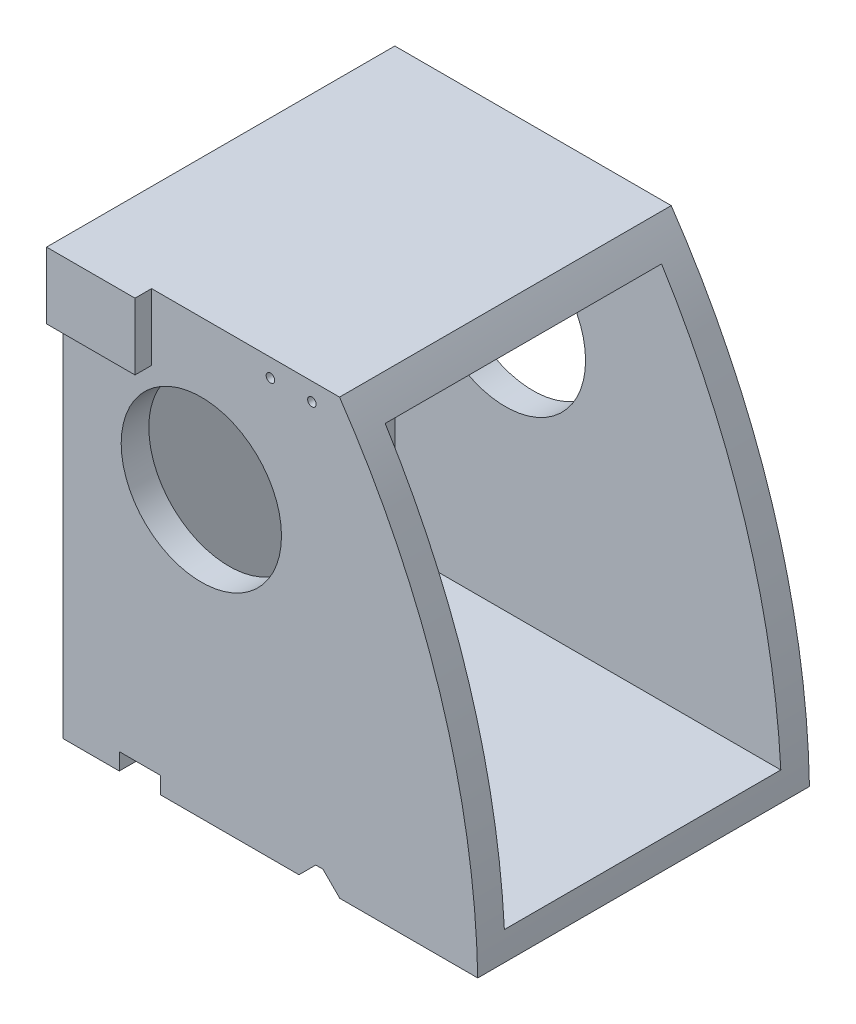
ISO-10303-21;
HEADER;
FILE_DESCRIPTION(('STEP AP214'),'2;1');
FILE_NAME('part.step','',(''),(''),'','','');
FILE_SCHEMA(('AUTOMOTIVE_DESIGN { 1 0 10303 214 1 1 1 1 }'));
ENDSEC;
DATA;
#1=APPLICATION_CONTEXT('core data for automotive mechanical design processes');
#2=APPLICATION_PROTOCOL_DEFINITION('international standard','automotive_design',2000,#1);
#3=PRODUCT_CONTEXT('',#1,'mechanical');
#4=PRODUCT('Part','Part','',(#3));
#5=PRODUCT_RELATED_PRODUCT_CATEGORY('part','',(#4));
#6=PRODUCT_DEFINITION_FORMATION('','',#4);
#7=PRODUCT_DEFINITION_CONTEXT('part definition',#1,'design');
#8=PRODUCT_DEFINITION('design','',#6,#7);
#9=PRODUCT_DEFINITION_SHAPE('','',#8);
#10=(LENGTH_UNIT() NAMED_UNIT(*) SI_UNIT(.MILLI.,.METRE.));
#11=(NAMED_UNIT(*) PLANE_ANGLE_UNIT() SI_UNIT($,.RADIAN.));
#12=(NAMED_UNIT(*) SI_UNIT($,.STERADIAN.) SOLID_ANGLE_UNIT());
#13=UNCERTAINTY_MEASURE_WITH_UNIT(LENGTH_MEASURE(1.E-05),#10,'distance_accuracy_value','');
#14=(GEOMETRIC_REPRESENTATION_CONTEXT(3) GLOBAL_UNCERTAINTY_ASSIGNED_CONTEXT((#13)) GLOBAL_UNIT_ASSIGNED_CONTEXT((#10,
#11,#12)) REPRESENTATION_CONTEXT('',''));
#15=CARTESIAN_POINT('',(0.,0.,0.));
#16=DIRECTION('',(0.,0.,1.));
#17=DIRECTION('',(1.,0.,0.));
#18=AXIS2_PLACEMENT_3D('',#15,#16,#17);
#19=CARTESIAN_POINT('',(-149.003633566678,-18.1360914015255,120.));
#20=DIRECTION('',(0.,0.,-1.));
#21=DIRECTION('',(-1.,0.,0.));
#22=AXIS2_PLACEMENT_3D('',#19,#20,#21);
#23=PLANE('',#22);
#24=CARTESIAN_POINT('',(64.9032258064516,137.910679099471,120.));
#25=DIRECTION('',(0.,0.,1.));
#26=DIRECTION('',(1.,0.,0.));
#27=AXIS2_PLACEMENT_3D('',#24,#25,#26);
#28=CIRCLE('',#27,1.5431870102377);
#29=CARTESIAN_POINT('',(66.4464128166893,137.910679099471,120.));
#30=VERTEX_POINT('',#29);
#31=EDGE_CURVE('E223',#30,#30,#28,.T.);
#32=ORIENTED_EDGE('',*,*,#31,.F.);
#33=EDGE_LOOP('',(#32));
#34=FACE_BOUND('',#33,.T.);
#35=CARTESIAN_POINT('',(79.9032258064516,137.910679099471,120.));
#36=DIRECTION('',(0.,0.,1.));
#37=DIRECTION('',(1.,0.,0.));
#38=AXIS2_PLACEMENT_3D('',#35,#36,#37);
#39=CIRCLE('',#38,1.5431870102377);
#40=CARTESIAN_POINT('',(81.4464128166893,137.910679099471,120.));
#41=VERTEX_POINT('',#40);
#42=EDGE_CURVE('E256',#41,#41,#39,.T.);
#43=ORIENTED_EDGE('',*,*,#42,.F.);
#44=EDGE_LOOP('',(#43));
#45=FACE_BOUND('',#44,.T.);
#46=CARTESIAN_POINT('',(39.9032258064516,90.4106790994713,120.));
#47=DIRECTION('',(0.,0.,1.));
#48=DIRECTION('',(1.,0.,0.));
#49=AXIS2_PLACEMENT_3D('',#46,#47,#48);
#50=CIRCLE('',#49,29.);
#51=CARTESIAN_POINT('',(68.9032258064516,90.4106790994713,120.));
#52=VERTEX_POINT('',#51);
#53=EDGE_CURVE('E251',#52,#52,#50,.T.);
#54=ORIENTED_EDGE('',*,*,#53,.F.);
#55=EDGE_LOOP('',(#54));
#56=FACE_BOUND('',#55,.T.);
#57=DIRECTION('',(0.,1.,0.));
#58=VECTOR('',#57,1.);
#59=CARTESIAN_POINT('',(21.9032258064516,144.410679099471,120.));
#60=LINE('',#59,#58);
#61=CARTESIAN_POINT('',(21.9032258064516,120.344673863571,120.));
#62=VERTEX_POINT('',#61);
#63=CARTESIAN_POINT('',(21.9032258064516,144.410679099471,120.));
#64=VERTEX_POINT('',#63);
#65=EDGE_CURVE('E190',#62,#64,#60,.T.);
#66=ORIENTED_EDGE('',*,*,#65,.F.);
#67=DIRECTION('',(1.,0.,0.));
#68=VECTOR('',#67,1.);
#69=CARTESIAN_POINT('',(-10.0967741935484,120.344673863571,120.));
#70=LINE('',#69,#68);
#71=CARTESIAN_POINT('',(-10.0967741935484,120.344673863571,120.));
#72=VERTEX_POINT('',#71);
#73=EDGE_CURVE('E55',#72,#62,#70,.T.);
#74=ORIENTED_EDGE('',*,*,#73,.F.);
#75=DIRECTION('',(0.,-1.,0.));
#76=VECTOR('',#75,1.);
#77=CARTESIAN_POINT('',(-10.0967741935484,144.410679099471,120.));
#78=LINE('',#77,#76);
#79=CARTESIAN_POINT('',(-10.0967741935484,-12.5893209005287,120.));
#80=VERTEX_POINT('',#79);
#81=EDGE_CURVE('E194',#72,#80,#78,.T.);
#82=ORIENTED_EDGE('',*,*,#81,.T.);
#83=DIRECTION('',(1.,0.,0.));
#84=VECTOR('',#83,1.);
#85=CARTESIAN_POINT('',(-10.0967741935484,-12.5893209005287,120.));
#86=LINE('',#85,#84);
#87=CARTESIAN_POINT('',(10.2155418262195,-12.5893209005287,120.));
#88=VERTEX_POINT('',#87);
#89=EDGE_CURVE('E322',#80,#88,#86,.T.);
#90=ORIENTED_EDGE('',*,*,#89,.T.);
#91=DIRECTION('',(0.,-1.,0.));
#92=VECTOR('',#91,1.);
#93=CARTESIAN_POINT('',(10.2155418262195,-12.5893209005287,120.));
#94=LINE('',#93,#92);
#95=CARTESIAN_POINT('',(10.2155418262195,-6.50411938261187,120.));
#96=VERTEX_POINT('',#95);
#97=EDGE_CURVE('E216',#96,#88,#94,.T.);
#98=ORIENTED_EDGE('',*,*,#97,.F.);
#99=DIRECTION('',(-1.,0.,0.));
#100=VECTOR('',#99,1.);
#101=CARTESIAN_POINT('',(25.2155418262195,-6.50411938261187,120.));
#102=LINE('',#101,#100);
#103=CARTESIAN_POINT('',(25.2155418262195,-6.50411938261187,120.));
#104=VERTEX_POINT('',#103);
#105=EDGE_CURVE('E211',#104,#96,#102,.T.);
#106=ORIENTED_EDGE('',*,*,#105,.F.);
#107=DIRECTION('',(0.,1.,0.));
#108=VECTOR('',#107,1.);
#109=CARTESIAN_POINT('',(25.2155418262195,-12.5893209005287,120.));
#110=LINE('',#109,#108);
#111=CARTESIAN_POINT('',(25.2155418262195,-12.5893209005287,120.));
#112=VERTEX_POINT('',#111);
#113=EDGE_CURVE('E207',#112,#104,#110,.T.);
#114=ORIENTED_EDGE('',*,*,#113,.F.);
#115=CARTESIAN_POINT('',(75.2155418262195,-12.5893209005287,120.));
#116=VERTEX_POINT('',#115);
#117=EDGE_CURVE('E327',#112,#116,#86,.T.);
#118=ORIENTED_EDGE('',*,*,#117,.T.);
#119=DIRECTION('',(-0.707106781186547,-0.707106781186548,0.));
#120=VECTOR('',#119,1.);
#121=CARTESIAN_POINT('',(75.2155418262195,-12.5893209005287,120.));
#122=LINE('',#121,#120);
#123=CARTESIAN_POINT('',(81.3007433441363,-6.50411938261186,120.));
#124=VERTEX_POINT('',#123);
#125=EDGE_CURVE('E236',#124,#116,#122,.T.);
#126=ORIENTED_EDGE('',*,*,#125,.F.);
#127=DIRECTION('',(-1.,0.,0.));
#128=VECTOR('',#127,1.);
#129=CARTESIAN_POINT('',(81.3007433441363,-6.50411938261186,120.));
#130=LINE('',#129,#128);
#131=CARTESIAN_POINT('',(83.9032258064516,-6.50411938261186,120.));
#132=VERTEX_POINT('',#131);
#133=EDGE_CURVE('E201',#132,#124,#130,.T.);
#134=ORIENTED_EDGE('',*,*,#133,.F.);
#135=DIRECTION('',(-0.707106781186546,0.707106781186549,0.));
#136=VECTOR('',#135,1.);
#137=CARTESIAN_POINT('',(83.9032258064516,-6.50411938261186,120.));
#138=LINE('',#137,#136);
#139=CARTESIAN_POINT('',(89.9884273243684,-12.5893209005287,120.));
#140=VERTEX_POINT('',#139);
#141=EDGE_CURVE('E196',#140,#132,#138,.T.);
#142=ORIENTED_EDGE('',*,*,#141,.F.);
#143=CARTESIAN_POINT('',(139.903225806452,-12.5893209005287,120.));
#144=VERTEX_POINT('',#143);
#145=EDGE_CURVE('E320',#140,#144,#86,.T.);
#146=ORIENTED_EDGE('',*,*,#145,.T.);
#147=CARTESIAN_POINT('',(-149.003633566678,-18.1360914015255,120.));
#148=DIRECTION('',(0.,0.,1.));
#149=DIRECTION('',(-1.,0.,0.));
#150=AXIS2_PLACEMENT_3D('',#147,#148,#149);
#151=CIRCLE('',#150,288.960101148647);
#152=CARTESIAN_POINT('',(89.9032258064516,144.410679099471,120.));
#153=VERTEX_POINT('',#152);
#154=EDGE_CURVE('E326',#144,#153,#151,.T.);
#155=ORIENTED_EDGE('',*,*,#154,.T.);
#156=DIRECTION('',(-1.,0.,0.));
#157=VECTOR('',#156,1.);
#158=CARTESIAN_POINT('',(-10.0967741935484,144.410679099471,120.));
#159=LINE('',#158,#157);
#160=EDGE_CURVE('E61',#153,#64,#159,.T.);
#161=ORIENTED_EDGE('',*,*,#160,.T.);
#162=EDGE_LOOP('',(#66,#74,#82,#90,#98,#106,#114,#118,#126,#134,#142,#146,#155,#161));
#163=FACE_BOUND('',#162,.T.);
#164=ADVANCED_FACE('F39',(#34,#45,#56,#163),#23,.F.);
#165=CARTESIAN_POINT('',(-10.0967741935484,-12.5893209005287,120.));
#166=DIRECTION('',(0.,1.,0.));
#167=DIRECTION('',(0.,0.,1.));
#168=AXIS2_PLACEMENT_3D('',#165,#166,#167);
#169=PLANE('',#168);
#170=ORIENTED_EDGE('',*,*,#117,.F.);
#171=DIRECTION('',(0.,0.,1.));
#172=VECTOR('',#171,1.);
#173=CARTESIAN_POINT('',(25.2155418262195,-12.5893209005287,-80.));
#174=LINE('',#173,#172);
#175=CARTESIAN_POINT('',(25.2155418262195,-12.5893209005287,0.));
#176=VERTEX_POINT('',#175);
#177=EDGE_CURVE('E220',#176,#112,#174,.T.);
#178=ORIENTED_EDGE('',*,*,#177,.F.);
#179=DIRECTION('',(1.,0.,0.));
#180=VECTOR('',#179,1.);
#181=CARTESIAN_POINT('',(-10.0967741935484,-12.5893209005287,0.));
#182=LINE('',#181,#180);
#183=CARTESIAN_POINT('',(75.2155418262195,-12.5893209005287,0.));
#184=VERTEX_POINT('',#183);
#185=EDGE_CURVE('E341',#176,#184,#182,.T.);
#186=ORIENTED_EDGE('',*,*,#185,.T.);
#187=DIRECTION('',(0.,0.,1.));
#188=VECTOR('',#187,1.);
#189=CARTESIAN_POINT('',(75.2155418262195,-12.5893209005287,-80.));
#190=LINE('',#189,#188);
#191=EDGE_CURVE('E212',#184,#116,#190,.T.);
#192=ORIENTED_EDGE('',*,*,#191,.T.);
#193=EDGE_LOOP('',(#170,#178,#186,#192));
#194=FACE_BOUND('',#193,.T.);
#195=ADVANCED_FACE('F427',(#194),#169,.F.);
#196=CARTESIAN_POINT('',(-10.0967741935484,-12.5893209005287,0.));
#197=VERTEX_POINT('',#196);
#198=CARTESIAN_POINT('',(10.2155418262195,-12.5893209005287,0.));
#199=VERTEX_POINT('',#198);
#200=EDGE_CURVE('E336',#197,#199,#182,.T.);
#201=ORIENTED_EDGE('',*,*,#200,.T.);
#202=DIRECTION('',(0.,0.,1.));
#203=VECTOR('',#202,1.);
#204=CARTESIAN_POINT('',(10.2155418262195,-12.5893209005287,-80.));
#205=LINE('',#204,#203);
#206=EDGE_CURVE('E224',#199,#88,#205,.T.);
#207=ORIENTED_EDGE('',*,*,#206,.T.);
#208=ORIENTED_EDGE('',*,*,#89,.F.);
#209=DIRECTION('',(0.,0.,-1.));
#210=VECTOR('',#209,1.);
#211=CARTESIAN_POINT('',(-10.0967741935484,-12.5893209005287,120.));
#212=LINE('',#211,#210);
#213=EDGE_CURVE('E356',#80,#197,#212,.T.);
#214=ORIENTED_EDGE('',*,*,#213,.T.);
#215=EDGE_LOOP('',(#201,#207,#208,#214));
#216=FACE_BOUND('',#215,.T.);
#217=ADVANCED_FACE('F405',(#216),#169,.F.);
#218=CARTESIAN_POINT('',(-149.003633566678,-18.1360914015255,120.));
#219=DIRECTION('',(0.,0.,-1.));
#220=DIRECTION('',(-1.,0.,0.));
#221=AXIS2_PLACEMENT_3D('',#218,#219,#220);
#222=CYLINDRICAL_SURFACE('',#221,288.960101148647);
#223=CARTESIAN_POINT('',(-149.003633566678,-18.1360914015255,0.));
#224=DIRECTION('',(0.,0.,1.));
#225=DIRECTION('',(-1.,0.,0.));
#226=AXIS2_PLACEMENT_3D('',#223,#224,#225);
#227=CIRCLE('',#226,288.960101148647);
#228=CARTESIAN_POINT('',(139.903225806452,-12.5893209005287,0.));
#229=VERTEX_POINT('',#228);
#230=CARTESIAN_POINT('',(89.9032258064516,144.410679099471,0.));
#231=VERTEX_POINT('',#230);
#232=EDGE_CURVE('E340',#229,#231,#227,.T.);
#233=ORIENTED_EDGE('',*,*,#232,.T.);
#234=DIRECTION('',(0.,0.,-1.));
#235=VECTOR('',#234,1.);
#236=CARTESIAN_POINT('',(89.9032258064516,144.410679099471,120.));
#237=LINE('',#236,#235);
#238=EDGE_CURVE('E348',#153,#231,#237,.T.);
#239=ORIENTED_EDGE('',*,*,#238,.F.);
#240=ORIENTED_EDGE('',*,*,#154,.F.);
#241=DIRECTION('',(0.,0.,-1.));
#242=VECTOR('',#241,1.);
#243=CARTESIAN_POINT('',(139.903225806452,-12.5893209005287,120.));
#244=LINE('',#243,#242);
#245=EDGE_CURVE('E352',#144,#229,#244,.T.);
#246=ORIENTED_EDGE('',*,*,#245,.T.);
#247=EDGE_LOOP('',(#233,#239,#240,#246));
#248=FACE_BOUND('',#247,.T.);
#249=CARTESIAN_POINT('',(-149.003633566678,-18.1360914015255,9.99999999999999));
#250=DIRECTION('',(0.,0.,-1.));
#251=DIRECTION('',(-1.,0.,0.));
#252=AXIS2_PLACEMENT_3D('',#249,#250,#251);
#253=CIRCLE('',#252,288.960101148647);
#254=CARTESIAN_POINT('',(139.537937065398,-2.58932090052872,10.));
#255=VERTEX_POINT('',#254);
#256=CARTESIAN_POINT('',(96.4091266263328,134.410679099471,10.));
#257=VERTEX_POINT('',#256);
#258=EDGE_CURVE('E298',#255,#257,#253,.F.);
#259=ORIENTED_EDGE('',*,*,#258,.F.);
#260=DIRECTION('',(0.,0.,-1.));
#261=VECTOR('',#260,1.);
#262=CARTESIAN_POINT('',(139.537937065398,-2.58932090052872,110.));
#263=LINE('',#262,#261);
#264=CARTESIAN_POINT('',(139.537937065398,-2.58932090052872,110.));
#265=VERTEX_POINT('',#264);
#266=EDGE_CURVE('E283',#265,#255,#263,.T.);
#267=ORIENTED_EDGE('',*,*,#266,.F.);
#268=CARTESIAN_POINT('',(-149.003633566678,-18.1360914015255,110.));
#269=DIRECTION('',(0.,0.,-1.));
#270=DIRECTION('',(-1.,0.,0.));
#271=AXIS2_PLACEMENT_3D('',#268,#269,#270);
#272=CIRCLE('',#271,288.960101148647);
#273=CARTESIAN_POINT('',(96.4091266263328,134.410679099471,110.));
#274=VERTEX_POINT('',#273);
#275=EDGE_CURVE('E302',#265,#274,#272,.F.);
#276=ORIENTED_EDGE('',*,*,#275,.T.);
#277=DIRECTION('',(0.,0.,-1.));
#278=VECTOR('',#277,1.);
#279=CARTESIAN_POINT('',(96.4091266263328,134.410679099471,110.));
#280=LINE('',#279,#278);
#281=EDGE_CURVE('E294',#274,#257,#280,.T.);
#282=ORIENTED_EDGE('',*,*,#281,.T.);
#283=EDGE_LOOP('',(#259,#267,#276,#282));
#284=FACE_BOUND('',#283,.T.);
#285=ADVANCED_FACE('F415',(#248,#284),#222,.T.);
#286=CARTESIAN_POINT('',(-10.0967741935484,144.410679099471,120.));
#287=DIRECTION('',(1.,0.,0.));
#288=DIRECTION('',(0.,1.,0.));
#289=AXIS2_PLACEMENT_3D('',#286,#287,#288);
#290=PLANE('',#289);
#291=DIRECTION('',(0.,-1.,0.));
#292=VECTOR('',#291,1.);
#293=CARTESIAN_POINT('',(-10.0967741935484,144.410679099471,0.));
#294=LINE('',#293,#292);
#295=CARTESIAN_POINT('',(-10.0967741935484,144.410679099471,0.));
#296=VERTEX_POINT('',#295);
#297=EDGE_CURVE('E282',#296,#197,#294,.T.);
#298=ORIENTED_EDGE('',*,*,#297,.T.);
#299=ORIENTED_EDGE('',*,*,#213,.F.);
#300=ORIENTED_EDGE('',*,*,#81,.F.);
#301=DIRECTION('',(0.,0.,-1.));
#302=VECTOR('',#301,1.);
#303=CARTESIAN_POINT('',(-10.0967741935484,120.344673863571,126.));
#304=LINE('',#303,#302);
#305=CARTESIAN_POINT('',(-10.0967741935484,120.344673863571,126.));
#306=VERTEX_POINT('',#305);
#307=EDGE_CURVE('E173',#306,#72,#304,.T.);
#308=ORIENTED_EDGE('',*,*,#307,.F.);
#309=DIRECTION('',(0.,-1.,0.));
#310=VECTOR('',#309,1.);
#311=CARTESIAN_POINT('',(-10.0967741935484,144.410679099471,126.));
#312=LINE('',#311,#310);
#313=CARTESIAN_POINT('',(-10.0967741935484,144.410679099471,126.));
#314=VERTEX_POINT('',#313);
#315=EDGE_CURVE('E180',#314,#306,#312,.T.);
#316=ORIENTED_EDGE('',*,*,#315,.F.);
#317=DIRECTION('',(0.,0.,-1.));
#318=VECTOR('',#317,1.);
#319=CARTESIAN_POINT('',(-10.0967741935484,144.410679099471,120.));
#320=LINE('',#319,#318);
#321=EDGE_CURVE('E332',#314,#296,#320,.T.);
#322=ORIENTED_EDGE('',*,*,#321,.T.);
#323=EDGE_LOOP('',(#298,#299,#300,#308,#316,#322));
#324=FACE_BOUND('',#323,.T.);
#325=ADVANCED_FACE('F41',(#324),#290,.F.);
#326=ORIENTED_EDGE('',*,*,#145,.F.);
#327=DIRECTION('',(0.,0.,1.));
#328=VECTOR('',#327,1.);
#329=CARTESIAN_POINT('',(89.9884273243684,-12.5893209005287,-80.));
#330=LINE('',#329,#328);
#331=CARTESIAN_POINT('',(89.9884273243684,-12.5893209005287,0.));
#332=VERTEX_POINT('',#331);
#333=EDGE_CURVE('E239',#332,#140,#330,.T.);
#334=ORIENTED_EDGE('',*,*,#333,.F.);
#335=EDGE_CURVE('E335',#332,#229,#182,.T.);
#336=ORIENTED_EDGE('',*,*,#335,.T.);
#337=ORIENTED_EDGE('',*,*,#245,.F.);
#338=EDGE_LOOP('',(#326,#334,#336,#337));
#339=FACE_BOUND('',#338,.T.);
#340=ADVANCED_FACE('F440',(#339),#169,.F.);
#341=CARTESIAN_POINT('',(-10.0967741935484,144.410679099471,120.));
#342=DIRECTION('',(0.,-1.,0.));
#343=DIRECTION('',(0.,0.,-1.));
#344=AXIS2_PLACEMENT_3D('',#341,#342,#343);
#345=PLANE('',#344);
#346=DIRECTION('',(-1.,0.,0.));
#347=VECTOR('',#346,1.);
#348=CARTESIAN_POINT('',(-10.0967741935484,144.410679099471,0.));
#349=LINE('',#348,#347);
#350=EDGE_CURVE('E321',#231,#296,#349,.T.);
#351=ORIENTED_EDGE('',*,*,#350,.T.);
#352=ORIENTED_EDGE('',*,*,#321,.F.);
#353=DIRECTION('',(-1.,0.,0.));
#354=VECTOR('',#353,1.);
#355=CARTESIAN_POINT('',(-10.0967741935484,144.410679099471,126.));
#356=LINE('',#355,#354);
#357=CARTESIAN_POINT('',(21.9032258064516,144.410679099471,126.));
#358=VERTEX_POINT('',#357);
#359=EDGE_CURVE('E186',#358,#314,#356,.T.);
#360=ORIENTED_EDGE('',*,*,#359,.F.);
#361=DIRECTION('',(0.,0.,-1.));
#362=VECTOR('',#361,1.);
#363=CARTESIAN_POINT('',(21.9032258064516,144.410679099471,126.));
#364=LINE('',#363,#362);
#365=EDGE_CURVE('E203',#358,#64,#364,.T.);
#366=ORIENTED_EDGE('',*,*,#365,.T.);
#367=ORIENTED_EDGE('',*,*,#160,.F.);
#368=ORIENTED_EDGE('',*,*,#238,.T.);
#369=EDGE_LOOP('',(#351,#352,#360,#366,#367,#368));
#370=FACE_BOUND('',#369,.T.);
#371=ADVANCED_FACE('F410',(#370),#345,.F.);
#372=CARTESIAN_POINT('',(-149.003633566678,-18.1360914015255,0.));
#373=DIRECTION('',(0.,0.,-1.));
#374=DIRECTION('',(-1.,0.,0.));
#375=AXIS2_PLACEMENT_3D('',#372,#373,#374);
#376=PLANE('',#375);
#377=DIRECTION('',(0.,-1.,0.));
#378=VECTOR('',#377,1.);
#379=CARTESIAN_POINT('',(25.2155418262195,-18.1360914015255,0.));
#380=LINE('',#379,#378);
#381=CARTESIAN_POINT('',(25.2155418262195,-6.50411938261187,0.));
#382=VERTEX_POINT('',#381);
#383=EDGE_CURVE('E11',#382,#176,#380,.T.);
#384=ORIENTED_EDGE('',*,*,#383,.F.);
#385=DIRECTION('',(1.,0.,0.));
#386=VECTOR('',#385,1.);
#387=CARTESIAN_POINT('',(-149.003633566678,-6.50411938261189,0.));
#388=LINE('',#387,#386);
#389=CARTESIAN_POINT('',(10.2155418262195,-6.50411938261187,0.));
#390=VERTEX_POINT('',#389);
#391=EDGE_CURVE('E379',#390,#382,#388,.T.);
#392=ORIENTED_EDGE('',*,*,#391,.F.);
#393=DIRECTION('',(0.,1.,0.));
#394=VECTOR('',#393,1.);
#395=CARTESIAN_POINT('',(10.2155418262195,-18.1360914015255,0.));
#396=LINE('',#395,#394);
#397=EDGE_CURVE('E48',#199,#390,#396,.T.);
#398=ORIENTED_EDGE('',*,*,#397,.F.);
#399=ORIENTED_EDGE('',*,*,#200,.F.);
#400=ORIENTED_EDGE('',*,*,#297,.F.);
#401=ORIENTED_EDGE('',*,*,#350,.F.);
#402=ORIENTED_EDGE('',*,*,#232,.F.);
#403=ORIENTED_EDGE('',*,*,#335,.F.);
#404=DIRECTION('',(0.707106781186546,-0.707106781186549,0.));
#405=VECTOR('',#404,1.);
#406=CARTESIAN_POINT('',(-26.7342178706559,104.133324294496,0.));
#407=LINE('',#406,#405);
#408=CARTESIAN_POINT('',(83.9032258064516,-6.50411938261186,0.));
#409=VERTEX_POINT('',#408);
#410=EDGE_CURVE('E360',#409,#332,#407,.T.);
#411=ORIENTED_EDGE('',*,*,#410,.F.);
#412=DIRECTION('',(1.,0.,0.));
#413=VECTOR('',#412,1.);
#414=CARTESIAN_POINT('',(-149.003633566678,-6.50411938261186,0.));
#415=LINE('',#414,#413);
#416=CARTESIAN_POINT('',(81.3007433441363,-6.50411938261186,0.));
#417=VERTEX_POINT('',#416);
#418=EDGE_CURVE('E372',#417,#409,#415,.T.);
#419=ORIENTED_EDGE('',*,*,#418,.F.);
#420=DIRECTION('',(0.707106781186547,0.707106781186548,0.));
#421=VECTOR('',#420,1.);
#422=CARTESIAN_POINT('',(-39.6674311207275,-127.472293847476,0.));
#423=LINE('',#422,#421);
#424=EDGE_CURVE('E376',#184,#417,#423,.T.);
#425=ORIENTED_EDGE('',*,*,#424,.F.);
#426=ORIENTED_EDGE('',*,*,#185,.F.);
#427=EDGE_LOOP('',(#384,#392,#398,#399,#400,#401,#402,#403,#411,#419,#425,#426));
#428=FACE_BOUND('',#427,.T.);
#429=CARTESIAN_POINT('',(39.9032258064516,90.4106790994713,0.));
#430=DIRECTION('',(0.,0.,-1.));
#431=DIRECTION('',(-1.,0.,0.));
#432=AXIS2_PLACEMENT_3D('',#429,#430,#431);
#433=CIRCLE('',#432,29.);
#434=CARTESIAN_POINT('',(10.9032258064516,90.4106790994713,0.));
#435=VERTEX_POINT('',#434);
#436=EDGE_CURVE('E267',#435,#435,#433,.T.);
#437=ORIENTED_EDGE('',*,*,#436,.F.);
#438=EDGE_LOOP('',(#437));
#439=FACE_BOUND('',#438,.T.);
#440=CARTESIAN_POINT('',(79.9032258064516,137.910679099471,0.));
#441=DIRECTION('',(0.,0.,-1.));
#442=DIRECTION('',(-1.,0.,0.));
#443=AXIS2_PLACEMENT_3D('',#440,#441,#442);
#444=CIRCLE('',#443,1.5431870102377);
#445=CARTESIAN_POINT('',(78.3600387962139,137.910679099471,0.));
#446=VERTEX_POINT('',#445);
#447=EDGE_CURVE('E277',#446,#446,#444,.T.);
#448=ORIENTED_EDGE('',*,*,#447,.F.);
#449=EDGE_LOOP('',(#448));
#450=FACE_BOUND('',#449,.T.);
#451=CARTESIAN_POINT('',(64.9032258064516,137.910679099471,0.));
#452=DIRECTION('',(0.,0.,-1.));
#453=DIRECTION('',(-1.,0.,0.));
#454=AXIS2_PLACEMENT_3D('',#451,#452,#453);
#455=CIRCLE('',#454,1.5431870102377);
#456=CARTESIAN_POINT('',(63.3600387962139,137.910679099471,0.));
#457=VERTEX_POINT('',#456);
#458=EDGE_CURVE('E271',#457,#457,#455,.T.);
#459=ORIENTED_EDGE('',*,*,#458,.F.);
#460=EDGE_LOOP('',(#459));
#461=FACE_BOUND('',#460,.T.);
#462=ADVANCED_FACE('F389',(#428,#439,#450,#461),#376,.T.);
#463=CARTESIAN_POINT('',(-0.0967741935484056,144.410679099471,120.));
#464=DIRECTION('',(1.,0.,0.));
#465=DIRECTION('',(0.,1.,0.));
#466=AXIS2_PLACEMENT_3D('',#463,#464,#465);
#467=PLANE('',#466);
#468=DIRECTION('',(0.,-1.,0.));
#469=VECTOR('',#468,1.);
#470=CARTESIAN_POINT('',(-0.0967741935483935,-18.1360914015255,10.));
#471=LINE('',#470,#469);
#472=CARTESIAN_POINT('',(-0.0967741935484058,134.410679099471,10.));
#473=VERTEX_POINT('',#472);
#474=CARTESIAN_POINT('',(-0.0967741935484088,-2.58932090052872,10.));
#475=VERTEX_POINT('',#474);
#476=EDGE_CURVE('E272',#473,#475,#471,.T.);
#477=ORIENTED_EDGE('',*,*,#476,.F.);
#478=DIRECTION('',(0.,0.,-1.));
#479=VECTOR('',#478,1.);
#480=CARTESIAN_POINT('',(-0.0967741935484058,134.410679099471,120.));
#481=LINE('',#480,#479);
#482=CARTESIAN_POINT('',(-0.0967741935484058,134.410679099471,110.));
#483=VERTEX_POINT('',#482);
#484=EDGE_CURVE('E290',#483,#473,#481,.T.);
#485=ORIENTED_EDGE('',*,*,#484,.F.);
#486=DIRECTION('',(0.,-1.,0.));
#487=VECTOR('',#486,1.);
#488=CARTESIAN_POINT('',(-0.0967741935483935,-18.1360914015255,110.));
#489=LINE('',#488,#487);
#490=CARTESIAN_POINT('',(-0.0967741935484088,-2.58932090052872,110.));
#491=VERTEX_POINT('',#490);
#492=EDGE_CURVE('E284',#483,#491,#489,.T.);
#493=ORIENTED_EDGE('',*,*,#492,.T.);
#494=DIRECTION('',(0.,0.,-1.));
#495=VECTOR('',#494,1.);
#496=CARTESIAN_POINT('',(-0.0967741935484091,-2.58932090052872,120.));
#497=LINE('',#496,#495);
#498=EDGE_CURVE('E278',#491,#475,#497,.T.);
#499=ORIENTED_EDGE('',*,*,#498,.T.);
#500=EDGE_LOOP('',(#477,#485,#493,#499));
#501=FACE_BOUND('',#500,.T.);
#502=ADVANCED_FACE('F462',(#501),#467,.T.);
#503=CARTESIAN_POINT('',(-10.0967741935484,-2.58932090052872,120.));
#504=DIRECTION('',(0.,1.,0.));
#505=DIRECTION('',(0.,0.,1.));
#506=AXIS2_PLACEMENT_3D('',#503,#504,#505);
#507=PLANE('',#506);
#508=DIRECTION('',(1.,0.,0.));
#509=VECTOR('',#508,1.);
#510=CARTESIAN_POINT('',(-149.003633566678,-2.58932090052872,10.));
#511=LINE('',#510,#509);
#512=EDGE_CURVE('E276',#475,#255,#511,.T.);
#513=ORIENTED_EDGE('',*,*,#512,.F.);
#514=ORIENTED_EDGE('',*,*,#498,.F.);
#515=DIRECTION('',(1.,0.,0.));
#516=VECTOR('',#515,1.);
#517=CARTESIAN_POINT('',(-149.003633566678,-2.58932090052872,110.));
#518=LINE('',#517,#516);
#519=EDGE_CURVE('E288',#491,#265,#518,.T.);
#520=ORIENTED_EDGE('',*,*,#519,.T.);
#521=ORIENTED_EDGE('',*,*,#266,.T.);
#522=EDGE_LOOP('',(#513,#514,#520,#521));
#523=FACE_BOUND('',#522,.T.);
#524=ADVANCED_FACE('F544',(#523),#507,.T.);
#525=CARTESIAN_POINT('',(-10.0967741935484,134.410679099471,120.));
#526=DIRECTION('',(0.,-1.,0.));
#527=DIRECTION('',(0.,0.,-1.));
#528=AXIS2_PLACEMENT_3D('',#525,#526,#527);
#529=PLANE('',#528);
#530=DIRECTION('',(-1.,0.,0.));
#531=VECTOR('',#530,1.);
#532=CARTESIAN_POINT('',(-149.003633566678,134.410679099471,10.));
#533=LINE('',#532,#531);
#534=EDGE_CURVE('E289',#257,#473,#533,.T.);
#535=ORIENTED_EDGE('',*,*,#534,.F.);
#536=ORIENTED_EDGE('',*,*,#281,.F.);
#537=DIRECTION('',(-1.,0.,0.));
#538=VECTOR('',#537,1.);
#539=CARTESIAN_POINT('',(-149.003633566678,134.410679099471,110.));
#540=LINE('',#539,#538);
#541=EDGE_CURVE('E295',#274,#483,#540,.T.);
#542=ORIENTED_EDGE('',*,*,#541,.T.);
#543=ORIENTED_EDGE('',*,*,#484,.T.);
#544=EDGE_LOOP('',(#535,#536,#542,#543));
#545=FACE_BOUND('',#544,.T.);
#546=ADVANCED_FACE('F548',(#545),#529,.T.);
#547=CARTESIAN_POINT('',(-149.003633566678,-18.1360914015255,110.));
#548=DIRECTION('',(0.,0.,-1.));
#549=DIRECTION('',(-1.,0.,0.));
#550=AXIS2_PLACEMENT_3D('',#547,#548,#549);
#551=PLANE('',#550);
#552=CARTESIAN_POINT('',(39.9032258064516,90.4106790994713,110.));
#553=DIRECTION('',(0.,0.,-1.));
#554=DIRECTION('',(-1.,0.,0.));
#555=AXIS2_PLACEMENT_3D('',#552,#553,#554);
#556=CIRCLE('',#555,29.);
#557=CARTESIAN_POINT('',(10.9032258064516,90.4106790994713,110.));
#558=VERTEX_POINT('',#557);
#559=EDGE_CURVE('E263',#558,#558,#556,.T.);
#560=ORIENTED_EDGE('',*,*,#559,.F.);
#561=EDGE_LOOP('',(#560));
#562=FACE_BOUND('',#561,.T.);
#563=ORIENTED_EDGE('',*,*,#492,.F.);
#564=ORIENTED_EDGE('',*,*,#541,.F.);
#565=ORIENTED_EDGE('',*,*,#275,.F.);
#566=ORIENTED_EDGE('',*,*,#519,.F.);
#567=EDGE_LOOP('',(#563,#564,#565,#566));
#568=FACE_BOUND('',#567,.T.);
#569=ADVANCED_FACE('F551',(#562,#568),#551,.T.);
#570=CARTESIAN_POINT('',(-149.003633566678,-18.1360914015255,10.));
#571=DIRECTION('',(0.,0.,-1.));
#572=DIRECTION('',(-1.,0.,0.));
#573=AXIS2_PLACEMENT_3D('',#570,#571,#572);
#574=PLANE('',#573);
#575=CARTESIAN_POINT('',(39.9032258064516,90.4106790994713,9.99999999999999));
#576=DIRECTION('',(0.,0.,-1.));
#577=DIRECTION('',(-1.,0.,0.));
#578=AXIS2_PLACEMENT_3D('',#575,#576,#577);
#579=CIRCLE('',#578,29.);
#580=CARTESIAN_POINT('',(10.9032258064516,90.4106790994713,9.99999999999999));
#581=VERTEX_POINT('',#580);
#582=EDGE_CURVE('E255',#581,#581,#579,.T.);
#583=ORIENTED_EDGE('',*,*,#582,.T.);
#584=EDGE_LOOP('',(#583));
#585=FACE_BOUND('',#584,.T.);
#586=ORIENTED_EDGE('',*,*,#476,.T.);
#587=ORIENTED_EDGE('',*,*,#512,.T.);
#588=ORIENTED_EDGE('',*,*,#258,.T.);
#589=ORIENTED_EDGE('',*,*,#534,.T.);
#590=EDGE_LOOP('',(#586,#587,#588,#589));
#591=FACE_BOUND('',#590,.T.);
#592=ADVANCED_FACE('F459',(#585,#591),#574,.F.);
#593=CARTESIAN_POINT('',(39.9032258064516,90.4106790994713,-80.));
#594=DIRECTION('',(0.,0.,1.));
#595=DIRECTION('',(1.,0.,0.));
#596=AXIS2_PLACEMENT_3D('',#593,#594,#595);
#597=CYLINDRICAL_SURFACE('',#596,29.);
#598=ORIENTED_EDGE('',*,*,#436,.T.);
#599=EDGE_LOOP('',(#598));
#600=FACE_BOUND('',#599,.T.);
#601=ORIENTED_EDGE('',*,*,#582,.F.);
#602=EDGE_LOOP('',(#601));
#603=FACE_BOUND('',#602,.T.);
#604=ADVANCED_FACE('F534',(#600,#603),#597,.F.);
#605=ORIENTED_EDGE('',*,*,#559,.T.);
#606=EDGE_LOOP('',(#605));
#607=FACE_BOUND('',#606,.T.);
#608=ORIENTED_EDGE('',*,*,#53,.T.);
#609=EDGE_LOOP('',(#608));
#610=FACE_BOUND('',#609,.T.);
#611=ADVANCED_FACE('F530',(#607,#610),#597,.F.);
#612=CARTESIAN_POINT('',(64.9032258064516,137.910679099471,-80.));
#613=DIRECTION('',(0.,0.,1.));
#614=DIRECTION('',(1.,0.,0.));
#615=AXIS2_PLACEMENT_3D('',#612,#613,#614);
#616=CYLINDRICAL_SURFACE('',#615,1.5431870102377);
#617=ORIENTED_EDGE('',*,*,#458,.T.);
#618=EDGE_LOOP('',(#617));
#619=FACE_BOUND('',#618,.T.);
#620=ORIENTED_EDGE('',*,*,#31,.T.);
#621=EDGE_LOOP('',(#620));
#622=FACE_BOUND('',#621,.T.);
#623=ADVANCED_FACE('F533',(#619,#622),#616,.F.);
#624=CARTESIAN_POINT('',(79.9032258064516,137.910679099471,-80.));
#625=DIRECTION('',(0.,0.,1.));
#626=DIRECTION('',(1.,0.,0.));
#627=AXIS2_PLACEMENT_3D('',#624,#625,#626);
#628=CYLINDRICAL_SURFACE('',#627,1.5431870102377);
#629=ORIENTED_EDGE('',*,*,#447,.T.);
#630=EDGE_LOOP('',(#629));
#631=FACE_BOUND('',#630,.T.);
#632=ORIENTED_EDGE('',*,*,#42,.T.);
#633=EDGE_LOOP('',(#632));
#634=FACE_BOUND('',#633,.T.);
#635=ADVANCED_FACE('F524',(#631,#634),#628,.F.);
#636=CARTESIAN_POINT('',(75.2155418262195,-12.5893209005287,-80.));
#637=DIRECTION('',(-0.707106781186548,0.707106781186547,0.));
#638=DIRECTION('',(-0.707106781186547,-0.707106781186548,0.));
#639=AXIS2_PLACEMENT_3D('',#636,#637,#638);
#640=PLANE('',#639);
#641=ORIENTED_EDGE('',*,*,#424,.T.);
#642=DIRECTION('',(0.,0.,1.));
#643=VECTOR('',#642,1.);
#644=CARTESIAN_POINT('',(81.3007433441363,-6.50411938261186,-80.));
#645=LINE('',#644,#643);
#646=EDGE_CURVE('E243',#417,#124,#645,.T.);
#647=ORIENTED_EDGE('',*,*,#646,.T.);
#648=ORIENTED_EDGE('',*,*,#125,.T.);
#649=ORIENTED_EDGE('',*,*,#191,.F.);
#650=EDGE_LOOP('',(#641,#647,#648,#649));
#651=FACE_BOUND('',#650,.T.);
#652=ADVANCED_FACE('F431',(#651),#640,.F.);
#653=CARTESIAN_POINT('',(81.3007433441363,-6.50411938261186,-80.));
#654=DIRECTION('',(0.,1.,0.));
#655=DIRECTION('',(0.,0.,1.));
#656=AXIS2_PLACEMENT_3D('',#653,#654,#655);
#657=PLANE('',#656);
#658=ORIENTED_EDGE('',*,*,#418,.T.);
#659=DIRECTION('',(0.,0.,1.));
#660=VECTOR('',#659,1.);
#661=CARTESIAN_POINT('',(83.9032258064516,-6.50411938261186,-80.));
#662=LINE('',#661,#660);
#663=EDGE_CURVE('E246',#409,#132,#662,.T.);
#664=ORIENTED_EDGE('',*,*,#663,.T.);
#665=ORIENTED_EDGE('',*,*,#133,.T.);
#666=ORIENTED_EDGE('',*,*,#646,.F.);
#667=EDGE_LOOP('',(#658,#664,#665,#666));
#668=FACE_BOUND('',#667,.T.);
#669=ADVANCED_FACE('F433',(#668),#657,.F.);
#670=CARTESIAN_POINT('',(83.9032258064516,-6.50411938261186,-80.));
#671=DIRECTION('',(0.707106781186549,0.707106781186546,0.));
#672=DIRECTION('',(-0.707106781186546,0.707106781186549,0.));
#673=AXIS2_PLACEMENT_3D('',#670,#671,#672);
#674=PLANE('',#673);
#675=ORIENTED_EDGE('',*,*,#410,.T.);
#676=ORIENTED_EDGE('',*,*,#333,.T.);
#677=ORIENTED_EDGE('',*,*,#141,.T.);
#678=ORIENTED_EDGE('',*,*,#663,.F.);
#679=EDGE_LOOP('',(#675,#676,#677,#678));
#680=FACE_BOUND('',#679,.T.);
#681=ADVANCED_FACE('F521',(#680),#674,.F.);
#682=CARTESIAN_POINT('',(25.2155418262195,-12.5893209005287,-80.));
#683=DIRECTION('',(1.,0.,0.));
#684=DIRECTION('',(0.,0.,-1.));
#685=AXIS2_PLACEMENT_3D('',#682,#683,#684);
#686=PLANE('',#685);
#687=ORIENTED_EDGE('',*,*,#383,.T.);
#688=ORIENTED_EDGE('',*,*,#177,.T.);
#689=ORIENTED_EDGE('',*,*,#113,.T.);
#690=DIRECTION('',(0.,0.,1.));
#691=VECTOR('',#690,1.);
#692=CARTESIAN_POINT('',(25.2155418262195,-6.50411938261187,-80.));
#693=LINE('',#692,#691);
#694=EDGE_CURVE('E219',#382,#104,#693,.T.);
#695=ORIENTED_EDGE('',*,*,#694,.F.);
#696=EDGE_LOOP('',(#687,#688,#689,#695));
#697=FACE_BOUND('',#696,.T.);
#698=ADVANCED_FACE('F396',(#697),#686,.F.);
#699=CARTESIAN_POINT('',(10.2155418262195,-12.5893209005287,-80.));
#700=DIRECTION('',(-1.,0.,0.));
#701=DIRECTION('',(0.,0.,1.));
#702=AXIS2_PLACEMENT_3D('',#699,#700,#701);
#703=PLANE('',#702);
#704=ORIENTED_EDGE('',*,*,#397,.T.);
#705=DIRECTION('',(0.,0.,1.));
#706=VECTOR('',#705,1.);
#707=CARTESIAN_POINT('',(10.2155418262195,-6.50411938261187,-80.));
#708=LINE('',#707,#706);
#709=EDGE_CURVE('E228',#390,#96,#708,.T.);
#710=ORIENTED_EDGE('',*,*,#709,.T.);
#711=ORIENTED_EDGE('',*,*,#97,.T.);
#712=ORIENTED_EDGE('',*,*,#206,.F.);
#713=EDGE_LOOP('',(#704,#710,#711,#712));
#714=FACE_BOUND('',#713,.T.);
#715=ADVANCED_FACE('F386',(#714),#703,.F.);
#716=CARTESIAN_POINT('',(25.2155418262195,-6.50411938261187,-80.));
#717=DIRECTION('',(0.,1.,0.));
#718=DIRECTION('',(-1.,0.,0.));
#719=AXIS2_PLACEMENT_3D('',#716,#717,#718);
#720=PLANE('',#719);
#721=ORIENTED_EDGE('',*,*,#391,.T.);
#722=ORIENTED_EDGE('',*,*,#694,.T.);
#723=ORIENTED_EDGE('',*,*,#105,.T.);
#724=ORIENTED_EDGE('',*,*,#709,.F.);
#725=EDGE_LOOP('',(#721,#722,#723,#724));
#726=FACE_BOUND('',#725,.T.);
#727=ADVANCED_FACE('F394',(#726),#720,.F.);
#728=CARTESIAN_POINT('',(-10.0967741935484,120.344673863571,126.));
#729=DIRECTION('',(0.,1.,0.));
#730=DIRECTION('',(0.,0.,1.));
#731=AXIS2_PLACEMENT_3D('',#728,#729,#730);
#732=PLANE('',#731);
#733=ORIENTED_EDGE('',*,*,#73,.T.);
#734=DIRECTION('',(0.,0.,-1.));
#735=VECTOR('',#734,1.);
#736=CARTESIAN_POINT('',(21.9032258064516,120.344673863571,126.));
#737=LINE('',#736,#735);
#738=CARTESIAN_POINT('',(21.9032258064516,120.344673863571,126.));
#739=VERTEX_POINT('',#738);
#740=EDGE_CURVE('E175',#739,#62,#737,.T.);
#741=ORIENTED_EDGE('',*,*,#740,.F.);
#742=DIRECTION('',(1.,0.,0.));
#743=VECTOR('',#742,1.);
#744=CARTESIAN_POINT('',(-10.0967741935484,120.344673863571,126.));
#745=LINE('',#744,#743);
#746=EDGE_CURVE('E169',#306,#739,#745,.T.);
#747=ORIENTED_EDGE('',*,*,#746,.F.);
#748=ORIENTED_EDGE('',*,*,#307,.T.);
#749=EDGE_LOOP('',(#733,#741,#747,#748));
#750=FACE_BOUND('',#749,.T.);
#751=ADVANCED_FACE('F171',(#750),#732,.F.);
#752=CARTESIAN_POINT('',(21.9032258064516,144.410679099471,126.));
#753=DIRECTION('',(-1.,0.,0.));
#754=DIRECTION('',(0.,0.,1.));
#755=AXIS2_PLACEMENT_3D('',#752,#753,#754);
#756=PLANE('',#755);
#757=ORIENTED_EDGE('',*,*,#65,.T.);
#758=ORIENTED_EDGE('',*,*,#365,.F.);
#759=DIRECTION('',(0.,1.,0.));
#760=VECTOR('',#759,1.);
#761=CARTESIAN_POINT('',(21.9032258064516,144.410679099471,126.));
#762=LINE('',#761,#760);
#763=EDGE_CURVE('E179',#739,#358,#762,.T.);
#764=ORIENTED_EDGE('',*,*,#763,.F.);
#765=ORIENTED_EDGE('',*,*,#740,.T.);
#766=EDGE_LOOP('',(#757,#758,#764,#765));
#767=FACE_BOUND('',#766,.T.);
#768=ADVANCED_FACE('F493',(#767),#756,.F.);
#769=CARTESIAN_POINT('',(0.,0.,126.));
#770=DIRECTION('',(0.,0.,1.));
#771=DIRECTION('',(1.,0.,0.));
#772=AXIS2_PLACEMENT_3D('',#769,#770,#771);
#773=PLANE('',#772);
#774=ORIENTED_EDGE('',*,*,#315,.T.);
#775=ORIENTED_EDGE('',*,*,#746,.T.);
#776=ORIENTED_EDGE('',*,*,#763,.T.);
#777=ORIENTED_EDGE('',*,*,#359,.T.);
#778=EDGE_LOOP('',(#774,#775,#776,#777));
#779=FACE_BOUND('',#778,.T.);
#780=ADVANCED_FACE('F184',(#779),#773,.T.);
#781=CLOSED_SHELL('',(#164,#195,#217,#285,#325,#340,#371,#462,#502,#524,#546,#569,#592,#604,
#611,#623,#635,#652,#669,#681,#698,#715,#727,#751,#768,#780));
#782=MANIFOLD_SOLID_BREP('B2',#781);
#783=ADVANCED_BREP_SHAPE_REPRESENTATION('',(#18,#782),#14);
#784=SHAPE_DEFINITION_REPRESENTATION(#9,#783);
ENDSEC;
END-ISO-10303-21;
